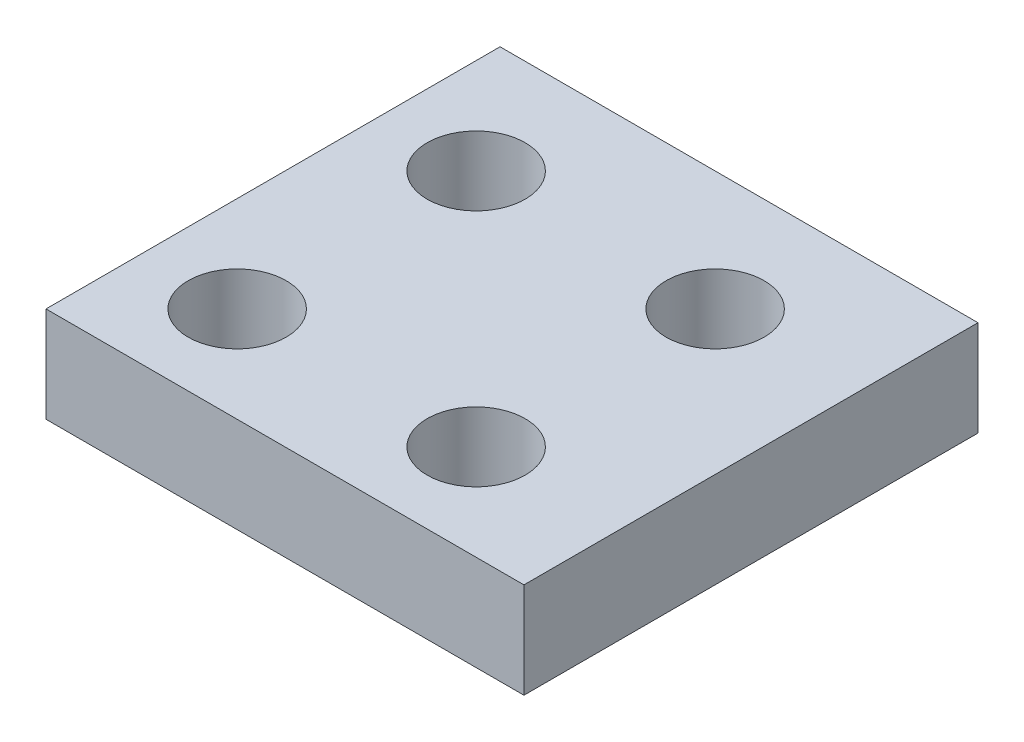
ISO-10303-21;
HEADER;
FILE_DESCRIPTION(('STEP AP214'),'2;1');
FILE_NAME('part.step','',(''),(''),'','','');
FILE_SCHEMA(('AUTOMOTIVE_DESIGN { 1 0 10303 214 1 1 1 1 }'));
ENDSEC;
DATA;
#1=APPLICATION_CONTEXT('core data for automotive mechanical design processes');
#2=APPLICATION_PROTOCOL_DEFINITION('international standard','automotive_design',2000,#1);
#3=PRODUCT_CONTEXT('',#1,'mechanical');
#4=PRODUCT('Part','Part','',(#3));
#5=PRODUCT_RELATED_PRODUCT_CATEGORY('part','',(#4));
#6=PRODUCT_DEFINITION_FORMATION('','',#4);
#7=PRODUCT_DEFINITION_CONTEXT('part definition',#1,'design');
#8=PRODUCT_DEFINITION('design','',#6,#7);
#9=PRODUCT_DEFINITION_SHAPE('','',#8);
#10=(LENGTH_UNIT() NAMED_UNIT(*) SI_UNIT(.MILLI.,.METRE.));
#11=(NAMED_UNIT(*) PLANE_ANGLE_UNIT() SI_UNIT($,.RADIAN.));
#12=(NAMED_UNIT(*) SI_UNIT($,.STERADIAN.) SOLID_ANGLE_UNIT());
#13=UNCERTAINTY_MEASURE_WITH_UNIT(LENGTH_MEASURE(1.E-05),#10,'distance_accuracy_value','');
#14=(GEOMETRIC_REPRESENTATION_CONTEXT(3) GLOBAL_UNCERTAINTY_ASSIGNED_CONTEXT((#13)) GLOBAL_UNIT_ASSIGNED_CONTEXT((#10,
#11,#12)) REPRESENTATION_CONTEXT('',''));
#15=CARTESIAN_POINT('',(0.,0.,0.));
#16=DIRECTION('',(0.,0.,1.));
#17=DIRECTION('',(1.,0.,0.));
#18=AXIS2_PLACEMENT_3D('',#15,#16,#17);
#19=CARTESIAN_POINT('',(0.,10.,0.));
#20=DIRECTION('',(0.,1.,0.));
#21=DIRECTION('',(0.,0.,1.));
#22=AXIS2_PLACEMENT_3D('',#19,#20,#21);
#23=PLANE('',#22);
#24=CARTESIAN_POINT('',(335.,10.,-10.));
#25=DIRECTION('',(0.,1.,0.));
#26=DIRECTION('',(0.,0.,1.));
#27=AXIS2_PLACEMENT_3D('',#24,#25,#26);
#28=CIRCLE('',#27,5.12499999999999);
#29=CARTESIAN_POINT('',(335.,10.,-4.87500000000002));
#30=VERTEX_POINT('',#29);
#31=EDGE_CURVE('E190',#30,#30,#28,.T.);
#32=ORIENTED_EDGE('',*,*,#31,.F.);
#33=EDGE_LOOP('',(#32));
#34=FACE_BOUND('',#33,.T.);
#35=CARTESIAN_POINT('',(310.,10.,-10.));
#36=DIRECTION('',(0.,1.,0.));
#37=DIRECTION('',(0.,0.,1.));
#38=AXIS2_PLACEMENT_3D('',#35,#36,#37);
#39=CIRCLE('',#38,5.12499999999999);
#40=CARTESIAN_POINT('',(310.,10.,-4.87500000000002));
#41=VERTEX_POINT('',#40);
#42=EDGE_CURVE('E165',#41,#41,#39,.T.);
#43=ORIENTED_EDGE('',*,*,#42,.F.);
#44=EDGE_LOOP('',(#43));
#45=FACE_BOUND('',#44,.T.);
#46=CARTESIAN_POINT('',(335.,10.,-35.));
#47=DIRECTION('',(0.,1.,0.));
#48=DIRECTION('',(0.,0.,1.));
#49=AXIS2_PLACEMENT_3D('',#46,#47,#48);
#50=CIRCLE('',#49,5.12499999999999);
#51=CARTESIAN_POINT('',(335.,10.,-29.875));
#52=VERTEX_POINT('',#51);
#53=EDGE_CURVE('E164',#52,#52,#50,.T.);
#54=ORIENTED_EDGE('',*,*,#53,.F.);
#55=EDGE_LOOP('',(#54));
#56=FACE_BOUND('',#55,.T.);
#57=CARTESIAN_POINT('',(310.,10.,-35.));
#58=DIRECTION('',(0.,1.,0.));
#59=DIRECTION('',(0.,0.,1.));
#60=AXIS2_PLACEMENT_3D('',#57,#58,#59);
#61=CIRCLE('',#60,5.12499999999999);
#62=CARTESIAN_POINT('',(310.,10.,-29.875));
#63=VERTEX_POINT('',#62);
#64=EDGE_CURVE('E177',#63,#63,#61,.T.);
#65=ORIENTED_EDGE('',*,*,#64,.F.);
#66=EDGE_LOOP('',(#65));
#67=FACE_BOUND('',#66,.T.);
#68=DIRECTION('',(-1.,0.,0.));
#69=VECTOR('',#68,1.);
#70=CARTESIAN_POINT('',(0.,10.,-47.5));
#71=LINE('',#70,#69);
#72=CARTESIAN_POINT('',(350.,10.,-47.5));
#73=VERTEX_POINT('',#72);
#74=CARTESIAN_POINT('',(300.,10.,-47.5));
#75=VERTEX_POINT('',#74);
#76=EDGE_CURVE('E193',#73,#75,#71,.T.);
#77=ORIENTED_EDGE('',*,*,#76,.T.);
#78=DIRECTION('',(0.,0.,1.));
#79=VECTOR('',#78,1.);
#80=CARTESIAN_POINT('',(300.,10.,0.));
#81=LINE('',#80,#79);
#82=CARTESIAN_POINT('',(300.,10.,0.));
#83=VERTEX_POINT('',#82);
#84=EDGE_CURVE('E117',#75,#83,#81,.T.);
#85=ORIENTED_EDGE('',*,*,#84,.T.);
#86=DIRECTION('',(1.,0.,0.));
#87=VECTOR('',#86,1.);
#88=CARTESIAN_POINT('',(350.000000000001,10.,0.));
#89=LINE('',#88,#87);
#90=CARTESIAN_POINT('',(350.000000000001,10.,0.));
#91=VERTEX_POINT('',#90);
#92=EDGE_CURVE('E156',#83,#91,#89,.T.);
#93=ORIENTED_EDGE('',*,*,#92,.T.);
#94=DIRECTION('',(0.,0.,-1.));
#95=VECTOR('',#94,1.);
#96=CARTESIAN_POINT('',(350.000000000001,10.,0.));
#97=LINE('',#96,#95);
#98=EDGE_CURVE('E172',#91,#73,#97,.T.);
#99=ORIENTED_EDGE('',*,*,#98,.T.);
#100=EDGE_LOOP('',(#77,#85,#93,#99));
#101=FACE_BOUND('',#100,.T.);
#102=ADVANCED_FACE('F99',(#34,#45,#56,#67,#101),#23,.T.);
#103=CARTESIAN_POINT('',(0.,0.,0.));
#104=DIRECTION('',(0.,1.,0.));
#105=DIRECTION('',(0.,0.,1.));
#106=AXIS2_PLACEMENT_3D('',#103,#104,#105);
#107=PLANE('',#106);
#108=CARTESIAN_POINT('',(335.,0.,-10.));
#109=DIRECTION('',(0.,1.,0.));
#110=DIRECTION('',(0.,0.,1.));
#111=AXIS2_PLACEMENT_3D('',#108,#109,#110);
#112=CIRCLE('',#111,5.12499999999999);
#113=CARTESIAN_POINT('',(335.,0.,-4.87500000000002));
#114=VERTEX_POINT('',#113);
#115=EDGE_CURVE('E187',#114,#114,#112,.T.);
#116=ORIENTED_EDGE('',*,*,#115,.T.);
#117=EDGE_LOOP('',(#116));
#118=FACE_BOUND('',#117,.T.);
#119=CARTESIAN_POINT('',(310.,0.,-10.));
#120=DIRECTION('',(0.,1.,0.));
#121=DIRECTION('',(0.,0.,1.));
#122=AXIS2_PLACEMENT_3D('',#119,#120,#121);
#123=CIRCLE('',#122,5.12499999999999);
#124=CARTESIAN_POINT('',(310.,0.,-4.87500000000002));
#125=VERTEX_POINT('',#124);
#126=EDGE_CURVE('E162',#125,#125,#123,.T.);
#127=ORIENTED_EDGE('',*,*,#126,.T.);
#128=EDGE_LOOP('',(#127));
#129=FACE_BOUND('',#128,.T.);
#130=CARTESIAN_POINT('',(335.,0.,-35.));
#131=DIRECTION('',(0.,1.,0.));
#132=DIRECTION('',(0.,0.,1.));
#133=AXIS2_PLACEMENT_3D('',#130,#131,#132);
#134=CIRCLE('',#133,5.12499999999999);
#135=CARTESIAN_POINT('',(335.,0.,-29.875));
#136=VERTEX_POINT('',#135);
#137=EDGE_CURVE('E180',#136,#136,#134,.T.);
#138=ORIENTED_EDGE('',*,*,#137,.T.);
#139=EDGE_LOOP('',(#138));
#140=FACE_BOUND('',#139,.T.);
#141=CARTESIAN_POINT('',(310.,0.,-35.));
#142=DIRECTION('',(0.,1.,0.));
#143=DIRECTION('',(0.,0.,1.));
#144=AXIS2_PLACEMENT_3D('',#141,#142,#143);
#145=CIRCLE('',#144,5.12499999999999);
#146=CARTESIAN_POINT('',(310.,0.,-29.875));
#147=VERTEX_POINT('',#146);
#148=EDGE_CURVE('E170',#147,#147,#145,.T.);
#149=ORIENTED_EDGE('',*,*,#148,.T.);
#150=EDGE_LOOP('',(#149));
#151=FACE_BOUND('',#150,.T.);
#152=DIRECTION('',(0.,0.,-1.));
#153=VECTOR('',#152,1.);
#154=CARTESIAN_POINT('',(300.,1.13659082146E-11,0.));
#155=LINE('',#154,#153);
#156=CARTESIAN_POINT('',(300.,1.13659082146E-11,0.));
#157=VERTEX_POINT('',#156);
#158=CARTESIAN_POINT('',(300.,1.13659082146E-11,-47.5));
#159=VERTEX_POINT('',#158);
#160=EDGE_CURVE('E142',#157,#159,#155,.T.);
#161=ORIENTED_EDGE('',*,*,#160,.T.);
#162=DIRECTION('',(-1.,0.,0.));
#163=VECTOR('',#162,1.);
#164=CARTESIAN_POINT('',(0.,0.,-47.5));
#165=LINE('',#164,#163);
#166=CARTESIAN_POINT('',(350.000000000001,0.,-47.5));
#167=VERTEX_POINT('',#166);
#168=EDGE_CURVE('E109',#167,#159,#165,.T.);
#169=ORIENTED_EDGE('',*,*,#168,.F.);
#170=DIRECTION('',(0.,0.,-1.));
#171=VECTOR('',#170,1.);
#172=CARTESIAN_POINT('',(350.000000000001,0.,0.));
#173=LINE('',#172,#171);
#174=CARTESIAN_POINT('',(350.000000000001,0.,0.));
#175=VERTEX_POINT('',#174);
#176=EDGE_CURVE('E168',#175,#167,#173,.T.);
#177=ORIENTED_EDGE('',*,*,#176,.F.);
#178=DIRECTION('',(1.,0.,0.));
#179=VECTOR('',#178,1.);
#180=CARTESIAN_POINT('',(350.000000000001,0.,0.));
#181=LINE('',#180,#179);
#182=EDGE_CURVE('E103',#157,#175,#181,.T.);
#183=ORIENTED_EDGE('',*,*,#182,.F.);
#184=EDGE_LOOP('',(#161,#169,#177,#183));
#185=FACE_BOUND('',#184,.T.);
#186=ADVANCED_FACE('F147',(#118,#129,#140,#151,#185),#107,.F.);
#187=CARTESIAN_POINT('',(350.000000000001,10.,0.));
#188=DIRECTION('',(0.,0.,-1.));
#189=DIRECTION('',(-1.,0.,0.));
#190=AXIS2_PLACEMENT_3D('',#187,#188,#189);
#191=PLANE('',#190);
#192=DIRECTION('',(0.,-1.,0.));
#193=VECTOR('',#192,1.);
#194=CARTESIAN_POINT('',(300.,50.0000000000114,0.));
#195=LINE('',#194,#193);
#196=EDGE_CURVE('E150',#83,#157,#195,.T.);
#197=ORIENTED_EDGE('',*,*,#196,.T.);
#198=ORIENTED_EDGE('',*,*,#182,.T.);
#199=DIRECTION('',(0.,-1.,0.));
#200=VECTOR('',#199,1.);
#201=CARTESIAN_POINT('',(350.000000000001,10.,0.));
#202=LINE('',#201,#200);
#203=EDGE_CURVE('E153',#91,#175,#202,.T.);
#204=ORIENTED_EDGE('',*,*,#203,.F.);
#205=ORIENTED_EDGE('',*,*,#92,.F.);
#206=EDGE_LOOP('',(#197,#198,#204,#205));
#207=FACE_BOUND('',#206,.T.);
#208=ADVANCED_FACE('F205',(#207),#191,.F.);
#209=CARTESIAN_POINT('',(350.,29.9999999999727,-47.5));
#210=DIRECTION('',(0.,0.,-1.));
#211=DIRECTION('',(-1.,0.,0.));
#212=AXIS2_PLACEMENT_3D('',#209,#210,#211);
#213=PLANE('',#212);
#214=ORIENTED_EDGE('',*,*,#168,.T.);
#215=DIRECTION('',(0.,1.,0.));
#216=VECTOR('',#215,1.);
#217=CARTESIAN_POINT('',(300.,29.9999999999727,-47.5));
#218=LINE('',#217,#216);
#219=EDGE_CURVE('E12',#159,#75,#218,.T.);
#220=ORIENTED_EDGE('',*,*,#219,.T.);
#221=ORIENTED_EDGE('',*,*,#76,.F.);
#222=DIRECTION('',(0.,-1.,0.));
#223=VECTOR('',#222,1.);
#224=CARTESIAN_POINT('',(350.,29.9999999999727,-47.5));
#225=LINE('',#224,#223);
#226=EDGE_CURVE('E124',#73,#167,#225,.T.);
#227=ORIENTED_EDGE('',*,*,#226,.T.);
#228=EDGE_LOOP('',(#214,#220,#221,#227));
#229=FACE_BOUND('',#228,.T.);
#230=ADVANCED_FACE('F152',(#229),#213,.T.);
#231=CARTESIAN_POINT('',(350.000000000001,10.,0.));
#232=DIRECTION('',(-1.,0.,0.));
#233=DIRECTION('',(0.,0.,1.));
#234=AXIS2_PLACEMENT_3D('',#231,#232,#233);
#235=PLANE('',#234);
#236=ORIENTED_EDGE('',*,*,#226,.F.);
#237=ORIENTED_EDGE('',*,*,#98,.F.);
#238=ORIENTED_EDGE('',*,*,#203,.T.);
#239=ORIENTED_EDGE('',*,*,#176,.T.);
#240=EDGE_LOOP('',(#236,#237,#238,#239));
#241=FACE_BOUND('',#240,.T.);
#242=ADVANCED_FACE('F101',(#241),#235,.F.);
#243=CARTESIAN_POINT('',(310.,10.,-35.));
#244=DIRECTION('',(0.,1.,0.));
#245=DIRECTION('',(0.,0.,1.));
#246=AXIS2_PLACEMENT_3D('',#243,#244,#245);
#247=CYLINDRICAL_SURFACE('',#246,5.12499999999999);
#248=ORIENTED_EDGE('',*,*,#64,.T.);
#249=EDGE_LOOP('',(#248));
#250=FACE_BOUND('',#249,.T.);
#251=ORIENTED_EDGE('',*,*,#148,.F.);
#252=EDGE_LOOP('',(#251));
#253=FACE_BOUND('',#252,.T.);
#254=ADVANCED_FACE('F211',(#250,#253),#247,.F.);
#255=CARTESIAN_POINT('',(335.,10.,-35.));
#256=DIRECTION('',(0.,1.,0.));
#257=DIRECTION('',(0.,0.,1.));
#258=AXIS2_PLACEMENT_3D('',#255,#256,#257);
#259=CYLINDRICAL_SURFACE('',#258,5.12499999999999);
#260=ORIENTED_EDGE('',*,*,#53,.T.);
#261=EDGE_LOOP('',(#260));
#262=FACE_BOUND('',#261,.T.);
#263=ORIENTED_EDGE('',*,*,#137,.F.);
#264=EDGE_LOOP('',(#263));
#265=FACE_BOUND('',#264,.T.);
#266=ADVANCED_FACE('F216',(#262,#265),#259,.F.);
#267=CARTESIAN_POINT('',(310.,10.,-10.));
#268=DIRECTION('',(0.,1.,0.));
#269=DIRECTION('',(0.,0.,1.));
#270=AXIS2_PLACEMENT_3D('',#267,#268,#269);
#271=CYLINDRICAL_SURFACE('',#270,5.12499999999999);
#272=ORIENTED_EDGE('',*,*,#42,.T.);
#273=EDGE_LOOP('',(#272));
#274=FACE_BOUND('',#273,.T.);
#275=ORIENTED_EDGE('',*,*,#126,.F.);
#276=EDGE_LOOP('',(#275));
#277=FACE_BOUND('',#276,.T.);
#278=ADVANCED_FACE('F259',(#274,#277),#271,.F.);
#279=CARTESIAN_POINT('',(335.,10.,-10.));
#280=DIRECTION('',(0.,1.,0.));
#281=DIRECTION('',(0.,0.,1.));
#282=AXIS2_PLACEMENT_3D('',#279,#280,#281);
#283=CYLINDRICAL_SURFACE('',#282,5.12499999999999);
#284=ORIENTED_EDGE('',*,*,#31,.T.);
#285=EDGE_LOOP('',(#284));
#286=FACE_BOUND('',#285,.T.);
#287=ORIENTED_EDGE('',*,*,#115,.F.);
#288=EDGE_LOOP('',(#287));
#289=FACE_BOUND('',#288,.T.);
#290=ADVANCED_FACE('F249',(#286,#289),#283,.F.);
#291=CARTESIAN_POINT('',(300.,50.0000000000114,0.));
#292=DIRECTION('',(-1.,0.,0.));
#293=DIRECTION('',(0.,0.,1.));
#294=AXIS2_PLACEMENT_3D('',#291,#292,#293);
#295=PLANE('',#294);
#296=ORIENTED_EDGE('',*,*,#219,.F.);
#297=ORIENTED_EDGE('',*,*,#160,.F.);
#298=ORIENTED_EDGE('',*,*,#196,.F.);
#299=ORIENTED_EDGE('',*,*,#84,.F.);
#300=EDGE_LOOP('',(#296,#297,#298,#299));
#301=FACE_BOUND('',#300,.T.);
#302=ADVANCED_FACE('F141',(#301),#295,.T.);
#303=CLOSED_SHELL('',(#102,#186,#208,#230,#242,#254,#266,#278,#290,#302));
#304=MANIFOLD_SOLID_BREP('B2',#303);
#305=ADVANCED_BREP_SHAPE_REPRESENTATION('',(#18,#304),#14);
#306=SHAPE_DEFINITION_REPRESENTATION(#9,#305);
ENDSEC;
END-ISO-10303-21;
